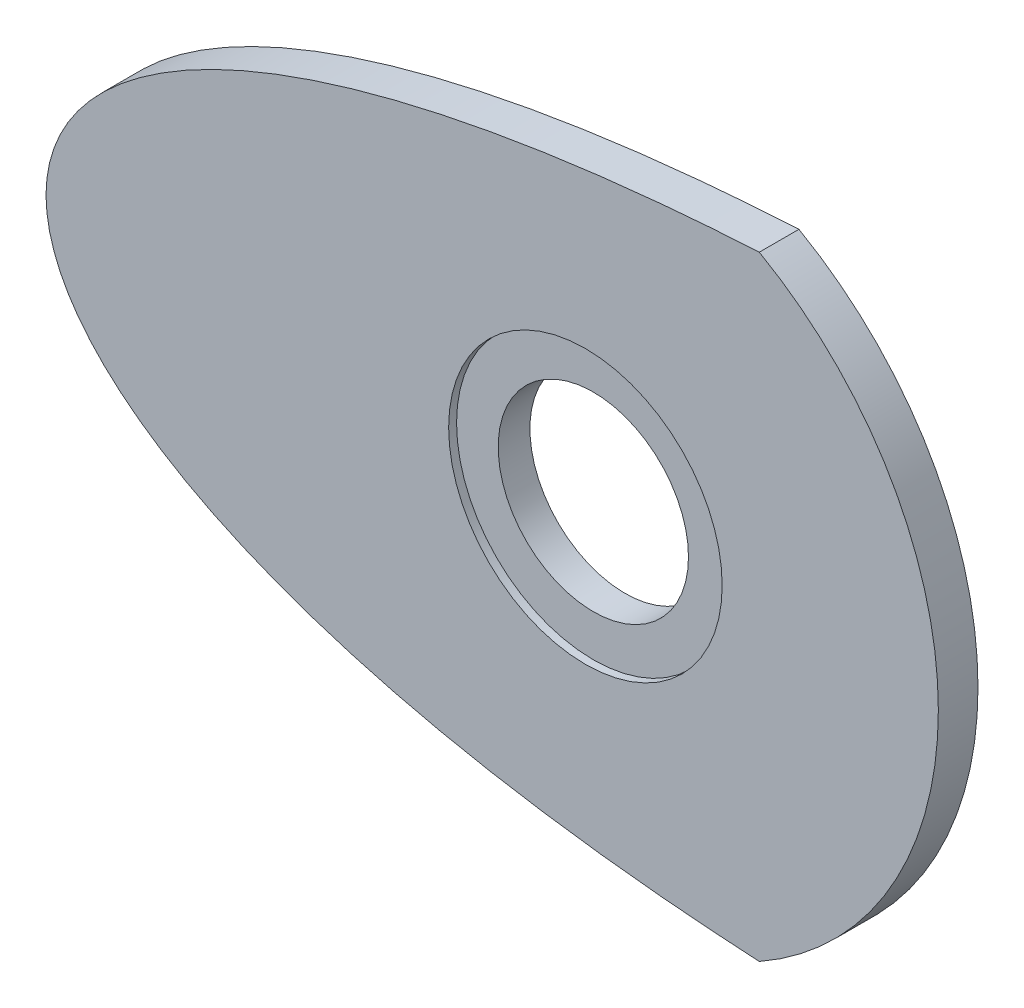
ISO-10303-21;
HEADER;
FILE_DESCRIPTION(('STEP AP214'),'2;1');
FILE_NAME('part.step','',(''),(''),'','','');
FILE_SCHEMA(('AUTOMOTIVE_DESIGN { 1 0 10303 214 1 1 1 1 }'));
ENDSEC;
DATA;
#1=APPLICATION_CONTEXT('core data for automotive mechanical design processes');
#2=APPLICATION_PROTOCOL_DEFINITION('international standard','automotive_design',2000,#1);
#3=PRODUCT_CONTEXT('',#1,'mechanical');
#4=PRODUCT('Part','Part','',(#3));
#5=PRODUCT_RELATED_PRODUCT_CATEGORY('part','',(#4));
#6=PRODUCT_DEFINITION_FORMATION('','',#4);
#7=PRODUCT_DEFINITION_CONTEXT('part definition',#1,'design');
#8=PRODUCT_DEFINITION('design','',#6,#7);
#9=PRODUCT_DEFINITION_SHAPE('','',#8);
#10=(LENGTH_UNIT() NAMED_UNIT(*) SI_UNIT(.MILLI.,.METRE.));
#11=(NAMED_UNIT(*) PLANE_ANGLE_UNIT() SI_UNIT($,.RADIAN.));
#12=(NAMED_UNIT(*) SI_UNIT($,.STERADIAN.) SOLID_ANGLE_UNIT());
#13=UNCERTAINTY_MEASURE_WITH_UNIT(LENGTH_MEASURE(1.E-05),#10,'distance_accuracy_value','');
#14=(GEOMETRIC_REPRESENTATION_CONTEXT(3) GLOBAL_UNCERTAINTY_ASSIGNED_CONTEXT((#13)) GLOBAL_UNIT_ASSIGNED_CONTEXT((#10,
#11,#12)) REPRESENTATION_CONTEXT('',''));
#15=CARTESIAN_POINT('',(0.,0.,0.));
#16=DIRECTION('',(0.,0.,1.));
#17=DIRECTION('',(1.,0.,0.));
#18=AXIS2_PLACEMENT_3D('',#15,#16,#17);
#19=CARTESIAN_POINT('',(-137.914431916084,26.8947524299864,2.53999999999999));
#20=DIRECTION('',(0.,0.,-1.));
#21=DIRECTION('',(-1.,0.,0.));
#22=AXIS2_PLACEMENT_3D('',#19,#20,#21);
#23=CYLINDRICAL_SURFACE('',#22,6.09599999999999);
#24=CARTESIAN_POINT('',(-137.914431916084,26.8947524299864,0.));
#25=DIRECTION('',(0.,0.,1.));
#26=DIRECTION('',(1.,0.,0.));
#27=AXIS2_PLACEMENT_3D('',#24,#25,#26);
#28=CIRCLE('',#27,6.09599999999999);
#29=CARTESIAN_POINT('',(-131.818431916084,26.8947524299864,0.));
#30=VERTEX_POINT('',#29);
#31=EDGE_CURVE('E175',#30,#30,#28,.T.);
#32=ORIENTED_EDGE('',*,*,#31,.F.);
#33=EDGE_LOOP('',(#32));
#34=FACE_BOUND('',#33,.T.);
#35=CARTESIAN_POINT('',(-137.914431916084,26.8947524299864,2.03200000000003));
#36=DIRECTION('',(0.,0.,1.));
#37=DIRECTION('',(1.,0.,0.));
#38=AXIS2_PLACEMENT_3D('',#35,#36,#37);
#39=CIRCLE('',#38,6.09599999999999);
#40=CARTESIAN_POINT('',(-131.818431916084,26.8947524299864,2.03200000000003));
#41=VERTEX_POINT('',#40);
#42=EDGE_CURVE('E57',#41,#41,#39,.T.);
#43=ORIENTED_EDGE('',*,*,#42,.T.);
#44=EDGE_LOOP('',(#43));
#45=FACE_BOUND('',#44,.T.);
#46=ADVANCED_FACE('F52',(#34,#45),#23,.F.);
#47=CARTESIAN_POINT('',(-172.474815081069,26.894752429986,2.53999999999999));
#48=CARTESIAN_POINT('',(-172.47381989117,27.2309738693238,2.53999999999999));
#49=CARTESIAN_POINT('',(-172.419747255577,28.0672232742455,2.53999999999999));
#50=CARTESIAN_POINT('',(-172.097783150049,29.5378516913755,2.53999999999999));
#51=CARTESIAN_POINT('',(-171.30584142183,31.3699698312645,2.53999999999999));
#52=CARTESIAN_POINT('',(-169.889362805425,33.3991008418593,2.53999999999999));
#53=CARTESIAN_POINT('',(-167.799877065202,35.466403755941,2.53999999999999));
#54=CARTESIAN_POINT('',(-165.058549527723,37.4623091277022,2.53999999999999));
#55=CARTESIAN_POINT('',(-161.711634875771,39.3214997242058,2.53999999999999));
#56=CARTESIAN_POINT('',(-157.809164116451,41.0061941364824,2.53999999999999));
#57=CARTESIAN_POINT('',(-153.398533523052,42.4940705878863,2.53999999999999));
#58=CARTESIAN_POINT('',(-148.523738699134,43.7718857495945,2.53999999999999));
#59=CARTESIAN_POINT('',(-143.225981341555,44.8321880471754,2.53999999999999));
#60=CARTESIAN_POINT('',(-137.544438785437,45.6714930007244,2.53999999999999));
#61=CARTESIAN_POINT('',(-132.017144620272,46.2388709365499,2.53999999999999));
#62=CARTESIAN_POINT('',(-128.386674126492,46.4859770463926,2.53999999999999));
#63=CARTESIAN_POINT('',(-126.772670278884,46.5740328296058,2.53999999999999));
#64=B_SPLINE_CURVE_WITH_KNOTS('',3,(#47,#48,#49,#50,#51,#52,#53,#54,#55,#56,#57,#58,#59,#60,#61,
#62,#63),.UNSPECIFIED.,.F.,.F.,(4,1,1,1,1,1,1,1,1,1,1,1,1,1,4),(0.5,0.502166768562745,
0.505390167385713,0.509655974305835,0.514947681887198,0.521244711429097,0.528520886222697,
0.536744945012688,0.545881360311019,0.555890751085959,0.566730118512969,0.578352990409744,
0.59070958813284,0.603747039427916,0.614168613353268),.UNSPECIFIED.);
#65=DIRECTION('',(0.,0.,-1.));
#66=VECTOR('',#65,1.);
#67=SURFACE_OF_LINEAR_EXTRUSION('',#64,#66);
#68=CARTESIAN_POINT('',(-172.474815081069,26.894752429986,0.));
#69=CARTESIAN_POINT('',(-172.47381989117,27.2309738693238,0.));
#70=CARTESIAN_POINT('',(-172.419747255577,28.0672232742455,0.));
#71=CARTESIAN_POINT('',(-172.097783150049,29.5378516913755,0.));
#72=CARTESIAN_POINT('',(-171.30584142183,31.3699698312645,0.));
#73=CARTESIAN_POINT('',(-169.889362805425,33.3991008418593,0.));
#74=CARTESIAN_POINT('',(-167.799877065202,35.466403755941,0.));
#75=CARTESIAN_POINT('',(-165.058549527723,37.4623091277022,0.));
#76=CARTESIAN_POINT('',(-161.711634875771,39.3214997242058,0.));
#77=CARTESIAN_POINT('',(-157.809164116451,41.0061941364824,0.));
#78=CARTESIAN_POINT('',(-153.398533523052,42.4940705878863,0.));
#79=CARTESIAN_POINT('',(-148.523738699134,43.7718857495945,0.));
#80=CARTESIAN_POINT('',(-143.225981341555,44.8321880471754,0.));
#81=CARTESIAN_POINT('',(-137.544438785437,45.6714930007244,0.));
#82=CARTESIAN_POINT('',(-132.017144620272,46.2388709365499,0.));
#83=CARTESIAN_POINT('',(-128.386674126492,46.4859770463926,0.));
#84=CARTESIAN_POINT('',(-126.772670278884,46.5740328296058,0.));
#85=B_SPLINE_CURVE_WITH_KNOTS('',3,(#68,#69,#70,#71,#72,#73,#74,#75,#76,#77,#78,#79,#80,#81,#82,
#83,#84),.UNSPECIFIED.,.F.,.F.,(4,1,1,1,1,1,1,1,1,1,1,1,1,1,4),(0.5,0.502166768562745,
0.505390167385713,0.509655974305835,0.514947681887198,0.521244711429097,0.528520886222697,
0.536744945012688,0.545881360311019,0.555890751085959,0.566730118512969,0.578352990409744,
0.59070958813284,0.603747039427916,0.614168613353268),.UNSPECIFIED.);
#86=CARTESIAN_POINT('',(-172.474815081069,26.894752429986,0.));
#87=VERTEX_POINT('',#86);
#88=CARTESIAN_POINT('',(-126.772670278884,46.5740328296058,0.));
#89=VERTEX_POINT('',#88);
#90=EDGE_CURVE('E98',#87,#89,#85,.T.);
#91=ORIENTED_EDGE('',*,*,#90,.F.);
#92=DIRECTION('',(0.,0.,-1.));
#93=VECTOR('',#92,1.);
#94=CARTESIAN_POINT('',(-172.474815081069,26.894752429986,2.53999999999999));
#95=LINE('',#94,#93);
#96=CARTESIAN_POINT('',(-172.474815081069,26.894752429986,2.53999999999999));
#97=VERTEX_POINT('',#96);
#98=EDGE_CURVE('E12',#97,#87,#95,.T.);
#99=ORIENTED_EDGE('',*,*,#98,.F.);
#100=CARTESIAN_POINT('',(-126.772670278884,46.5740328296058,2.53999999999999));
#101=VERTEX_POINT('',#100);
#102=EDGE_CURVE('E96',#97,#101,#64,.T.);
#103=ORIENTED_EDGE('',*,*,#102,.T.);
#104=DIRECTION('',(0.,0.,-1.));
#105=VECTOR('',#104,1.);
#106=CARTESIAN_POINT('',(-126.772670278884,46.5740328296058,2.53999999999999));
#107=LINE('',#106,#105);
#108=EDGE_CURVE('E75',#101,#89,#107,.T.);
#109=ORIENTED_EDGE('',*,*,#108,.T.);
#110=EDGE_LOOP('',(#91,#99,#103,#109));
#111=FACE_BOUND('',#110,.T.);
#112=ADVANCED_FACE('F54',(#111),#67,.T.);
#113=CARTESIAN_POINT('',(-172.474815081069,26.894752429986,2.53999999999999));
#114=CARTESIAN_POINT('',(-172.473819891167,26.5585309906414,2.53999999999999));
#115=CARTESIAN_POINT('',(-172.419747255565,25.7222815856991,2.53999999999999));
#116=CARTESIAN_POINT('',(-172.097783150016,24.2516531685357,2.53999999999999));
#117=CARTESIAN_POINT('',(-171.30584142176,22.4195350286086,2.53999999999999));
#118=CARTESIAN_POINT('',(-169.889362805302,20.3904040179765,2.53999999999999));
#119=CARTESIAN_POINT('',(-167.799877065009,18.3231011038623,2.53999999999999));
#120=CARTESIAN_POINT('',(-165.058549527443,16.3271957320767,2.53999999999999));
#121=CARTESIAN_POINT('',(-161.711634875392,14.4680051355579,2.53999999999999));
#122=CARTESIAN_POINT('',(-157.809164115961,12.783310723275,2.53999999999999));
#123=CARTESIAN_POINT('',(-153.398533522439,11.295434271874,2.53999999999999));
#124=CARTESIAN_POINT('',(-148.523738698389,10.0176191101791,2.53999999999999));
#125=CARTESIAN_POINT('',(-143.22598134067,8.95731681262013,2.53999999999999));
#126=CARTESIAN_POINT('',(-137.544438784404,8.11801185910155,2.53999999999999));
#127=CARTESIAN_POINT('',(-132.017144619532,7.55063392335675,2.53999999999999));
#128=CARTESIAN_POINT('',(-128.386674126095,7.30352781355603,2.53999999999999));
#129=CARTESIAN_POINT('',(-126.772670278884,7.21547203036732,2.53999999999999));
#130=B_SPLINE_CURVE_WITH_KNOTS('',3,(#113,#114,#115,#116,#117,#118,#119,#120,#121,#122,#123,
#124,#125,#126,#127,#128,#129),.UNSPECIFIED.,.F.,.F.,(4,1,1,1,1,1,1,1,1,1,1,1,1,1,4),(0.5,
0.502166768562745,0.505390167385713,0.509655974305835,0.514947681887198,0.521244711429097,
0.528520886222697,0.536744945012688,0.545881360311019,0.555890751085959,0.566730118512969,
0.578352990409744,0.59070958813284,0.603747039427916,0.614168613350452),.UNSPECIFIED.);
#131=DIRECTION('',(0.,0.,-1.));
#132=VECTOR('',#131,1.);
#133=SURFACE_OF_LINEAR_EXTRUSION('',#130,#132);
#134=CARTESIAN_POINT('',(-172.474815081069,26.894752429986,0.));
#135=CARTESIAN_POINT('',(-172.473819891167,26.5585309906414,0.));
#136=CARTESIAN_POINT('',(-172.419747255565,25.7222815856991,0.));
#137=CARTESIAN_POINT('',(-172.097783150016,24.2516531685357,0.));
#138=CARTESIAN_POINT('',(-171.30584142176,22.4195350286086,0.));
#139=CARTESIAN_POINT('',(-169.889362805302,20.3904040179765,0.));
#140=CARTESIAN_POINT('',(-167.799877065009,18.3231011038623,0.));
#141=CARTESIAN_POINT('',(-165.058549527443,16.3271957320767,0.));
#142=CARTESIAN_POINT('',(-161.711634875392,14.4680051355579,0.));
#143=CARTESIAN_POINT('',(-157.809164115961,12.783310723275,0.));
#144=CARTESIAN_POINT('',(-153.398533522439,11.295434271874,0.));
#145=CARTESIAN_POINT('',(-148.523738698389,10.0176191101791,0.));
#146=CARTESIAN_POINT('',(-143.22598134067,8.95731681262013,0.));
#147=CARTESIAN_POINT('',(-137.544438784404,8.11801185910155,0.));
#148=CARTESIAN_POINT('',(-132.017144619532,7.55063392335675,0.));
#149=CARTESIAN_POINT('',(-128.386674126095,7.30352781355603,0.));
#150=CARTESIAN_POINT('',(-126.772670278884,7.21547203036732,0.));
#151=B_SPLINE_CURVE_WITH_KNOTS('',3,(#134,#135,#136,#137,#138,#139,#140,#141,#142,#143,#144,
#145,#146,#147,#148,#149,#150),.UNSPECIFIED.,.F.,.F.,(4,1,1,1,1,1,1,1,1,1,1,1,1,1,4),(0.5,
0.502166768562745,0.505390167385713,0.509655974305835,0.514947681887198,0.521244711429097,
0.528520886222697,0.536744945012688,0.545881360311019,0.555890751085959,0.566730118512969,
0.578352990409744,0.59070958813284,0.603747039427916,0.614168613350452),.UNSPECIFIED.);
#152=CARTESIAN_POINT('',(-126.772670278884,7.21547203036732,0.));
#153=VERTEX_POINT('',#152);
#154=EDGE_CURVE('E113',#87,#153,#151,.T.);
#155=ORIENTED_EDGE('',*,*,#154,.T.);
#156=DIRECTION('',(0.,0.,-1.));
#157=VECTOR('',#156,1.);
#158=CARTESIAN_POINT('',(-126.772670278884,7.21547203036732,2.53999999999999));
#159=LINE('',#158,#157);
#160=CARTESIAN_POINT('',(-126.772670278884,7.21547203036732,2.53999999999999));
#161=VERTEX_POINT('',#160);
#162=EDGE_CURVE('E64',#161,#153,#159,.T.);
#163=ORIENTED_EDGE('',*,*,#162,.F.);
#164=EDGE_CURVE('E101',#97,#161,#130,.T.);
#165=ORIENTED_EDGE('',*,*,#164,.F.);
#166=ORIENTED_EDGE('',*,*,#98,.T.);
#167=EDGE_LOOP('',(#155,#163,#165,#166));
#168=FACE_BOUND('',#167,.T.);
#169=ADVANCED_FACE('F102',(#168),#133,.F.);
#170=CARTESIAN_POINT('',(-137.914431916084,26.8947524299864,2.53999999999999));
#171=DIRECTION('',(0.,0.,-1.));
#172=DIRECTION('',(-1.,0.,0.));
#173=AXIS2_PLACEMENT_3D('',#170,#171,#172);
#174=CYLINDRICAL_SURFACE('',#173,22.614440727708);
#175=CARTESIAN_POINT('',(-137.914431916084,26.8947524299864,0.));
#176=DIRECTION('',(0.,0.,1.));
#177=DIRECTION('',(1.,0.,0.));
#178=AXIS2_PLACEMENT_3D('',#175,#176,#177);
#179=CIRCLE('',#178,22.614440727708);
#180=EDGE_CURVE('E109',#89,#153,#179,.F.);
#181=ORIENTED_EDGE('',*,*,#180,.F.);
#182=ORIENTED_EDGE('',*,*,#108,.F.);
#183=CARTESIAN_POINT('',(-137.914431916084,26.8947524299864,2.53999999999999));
#184=DIRECTION('',(0.,0.,1.));
#185=DIRECTION('',(1.,0.,0.));
#186=AXIS2_PLACEMENT_3D('',#183,#184,#185);
#187=CIRCLE('',#186,22.614440727708);
#188=EDGE_CURVE('E105',#101,#161,#187,.F.);
#189=ORIENTED_EDGE('',*,*,#188,.T.);
#190=ORIENTED_EDGE('',*,*,#162,.T.);
#191=EDGE_LOOP('',(#181,#182,#189,#190));
#192=FACE_BOUND('',#191,.T.);
#193=ADVANCED_FACE('F134',(#192),#174,.T.);
#194=CARTESIAN_POINT('',(0.,0.,2.53999999999999));
#195=DIRECTION('',(0.,0.,1.));
#196=DIRECTION('',(1.,0.,0.));
#197=AXIS2_PLACEMENT_3D('',#194,#195,#196);
#198=PLANE('',#197);
#199=CARTESIAN_POINT('',(-137.914431916084,26.8947524299864,2.53999999999999));
#200=DIRECTION('',(0.,0.,1.));
#201=DIRECTION('',(1.,0.,0.));
#202=AXIS2_PLACEMENT_3D('',#199,#200,#201);
#203=CIRCLE('',#202,8.76299999999996);
#204=CARTESIAN_POINT('',(-129.151431916084,26.8947524299864,2.53999999999999));
#205=VERTEX_POINT('',#204);
#206=EDGE_CURVE('E171',#205,#205,#203,.T.);
#207=ORIENTED_EDGE('',*,*,#206,.F.);
#208=EDGE_LOOP('',(#207));
#209=FACE_BOUND('',#208,.T.);
#210=ORIENTED_EDGE('',*,*,#102,.F.);
#211=ORIENTED_EDGE('',*,*,#164,.T.);
#212=ORIENTED_EDGE('',*,*,#188,.F.);
#213=EDGE_LOOP('',(#210,#211,#212));
#214=FACE_BOUND('',#213,.T.);
#215=ADVANCED_FACE('F107',(#209,#214),#198,.T.);
#216=CARTESIAN_POINT('',(0.,0.,0.));
#217=DIRECTION('',(0.,0.,1.));
#218=DIRECTION('',(1.,0.,0.));
#219=AXIS2_PLACEMENT_3D('',#216,#217,#218);
#220=PLANE('',#219);
#221=ORIENTED_EDGE('',*,*,#31,.T.);
#222=EDGE_LOOP('',(#221));
#223=FACE_BOUND('',#222,.T.);
#224=CARTESIAN_POINT('',(-159.081098580634,26.8947524299865,0.));
#225=DIRECTION('',(0.,0.,1.));
#226=DIRECTION('',(1.,0.,0.));
#227=AXIS2_PLACEMENT_3D('',#224,#225,#226);
#228=CIRCLE('',#227,4.23333333159091);
#229=CARTESIAN_POINT('',(-154.847765249043,26.8947524299865,0.));
#230=VERTEX_POINT('',#229);
#231=EDGE_CURVE('E119',#230,#230,#228,.T.);
#232=ORIENTED_EDGE('',*,*,#231,.T.);
#233=EDGE_LOOP('',(#232));
#234=FACE_BOUND('',#233,.T.);
#235=ORIENTED_EDGE('',*,*,#90,.T.);
#236=ORIENTED_EDGE('',*,*,#180,.T.);
#237=ORIENTED_EDGE('',*,*,#154,.F.);
#238=EDGE_LOOP('',(#235,#236,#237));
#239=FACE_BOUND('',#238,.T.);
#240=ADVANCED_FACE('F137',(#223,#234,#239),#220,.F.);
#241=CARTESIAN_POINT('',(-159.081098580634,26.8947524299865,-7.61999999999996));
#242=DIRECTION('',(0.,0.,1.));
#243=DIRECTION('',(1.,0.,0.));
#244=AXIS2_PLACEMENT_3D('',#241,#242,#243);
#245=CYLINDRICAL_SURFACE('',#244,4.23333333159091);
#246=CARTESIAN_POINT('',(-159.081098580634,26.8947524299865,-7.61999999999996));
#247=DIRECTION('',(0.,0.,1.));
#248=DIRECTION('',(1.,0.,0.));
#249=AXIS2_PLACEMENT_3D('',#246,#247,#248);
#250=CIRCLE('',#249,4.23333333159091);
#251=CARTESIAN_POINT('',(-154.847765249043,26.8947524299865,-7.61999999999996));
#252=VERTEX_POINT('',#251);
#253=EDGE_CURVE('E181',#252,#252,#250,.T.);
#254=ORIENTED_EDGE('',*,*,#253,.T.);
#255=EDGE_LOOP('',(#254));
#256=FACE_BOUND('',#255,.T.);
#257=ORIENTED_EDGE('',*,*,#231,.F.);
#258=EDGE_LOOP('',(#257));
#259=FACE_BOUND('',#258,.T.);
#260=ADVANCED_FACE('F140',(#256,#259),#245,.T.);
#261=CARTESIAN_POINT('',(0.,0.,-7.61999999999996));
#262=DIRECTION('',(0.,0.,1.));
#263=DIRECTION('',(1.,0.,0.));
#264=AXIS2_PLACEMENT_3D('',#261,#262,#263);
#265=PLANE('',#264);
#266=ORIENTED_EDGE('',*,*,#253,.F.);
#267=EDGE_LOOP('',(#266));
#268=FACE_BOUND('',#267,.T.);
#269=ADVANCED_FACE('F147',(#268),#265,.F.);
#270=CARTESIAN_POINT('',(-137.914431916084,26.8947524299864,2.03200000000003));
#271=DIRECTION('',(0.,0.,1.));
#272=DIRECTION('',(1.,0.,0.));
#273=AXIS2_PLACEMENT_3D('',#270,#271,#272);
#274=CYLINDRICAL_SURFACE('',#273,8.76299999999996);
#275=CARTESIAN_POINT('',(-137.914431916084,26.8947524299864,2.03200000000003));
#276=DIRECTION('',(0.,0.,1.));
#277=DIRECTION('',(1.,0.,0.));
#278=AXIS2_PLACEMENT_3D('',#275,#276,#277);
#279=CIRCLE('',#278,8.76299999999996);
#280=CARTESIAN_POINT('',(-129.151431916084,26.8947524299864,2.03200000000003));
#281=VERTEX_POINT('',#280);
#282=EDGE_CURVE('E169',#281,#281,#279,.T.);
#283=ORIENTED_EDGE('',*,*,#282,.F.);
#284=EDGE_LOOP('',(#283));
#285=FACE_BOUND('',#284,.T.);
#286=ORIENTED_EDGE('',*,*,#206,.T.);
#287=EDGE_LOOP('',(#286));
#288=FACE_BOUND('',#287,.T.);
#289=ADVANCED_FACE('F151',(#285,#288),#274,.F.);
#290=CARTESIAN_POINT('',(-137.914431916084,26.8947524299864,2.03200000000003));
#291=DIRECTION('',(0.,0.,1.));
#292=DIRECTION('',(1.,0.,0.));
#293=AXIS2_PLACEMENT_3D('',#290,#291,#292);
#294=PLANE('',#293);
#295=ORIENTED_EDGE('',*,*,#42,.F.);
#296=EDGE_LOOP('',(#295));
#297=FACE_BOUND('',#296,.T.);
#298=ORIENTED_EDGE('',*,*,#282,.T.);
#299=EDGE_LOOP('',(#298));
#300=FACE_BOUND('',#299,.T.);
#301=ADVANCED_FACE('F158',(#297,#300),#294,.T.);
#302=CLOSED_SHELL('',(#46,#112,#169,#193,#215,#240,#260,#269,#289,#301));
#303=MANIFOLD_SOLID_BREP('B2',#302);
#304=ADVANCED_BREP_SHAPE_REPRESENTATION('',(#18,#303),#14);
#305=SHAPE_DEFINITION_REPRESENTATION(#9,#304);
ENDSEC;
END-ISO-10303-21;
